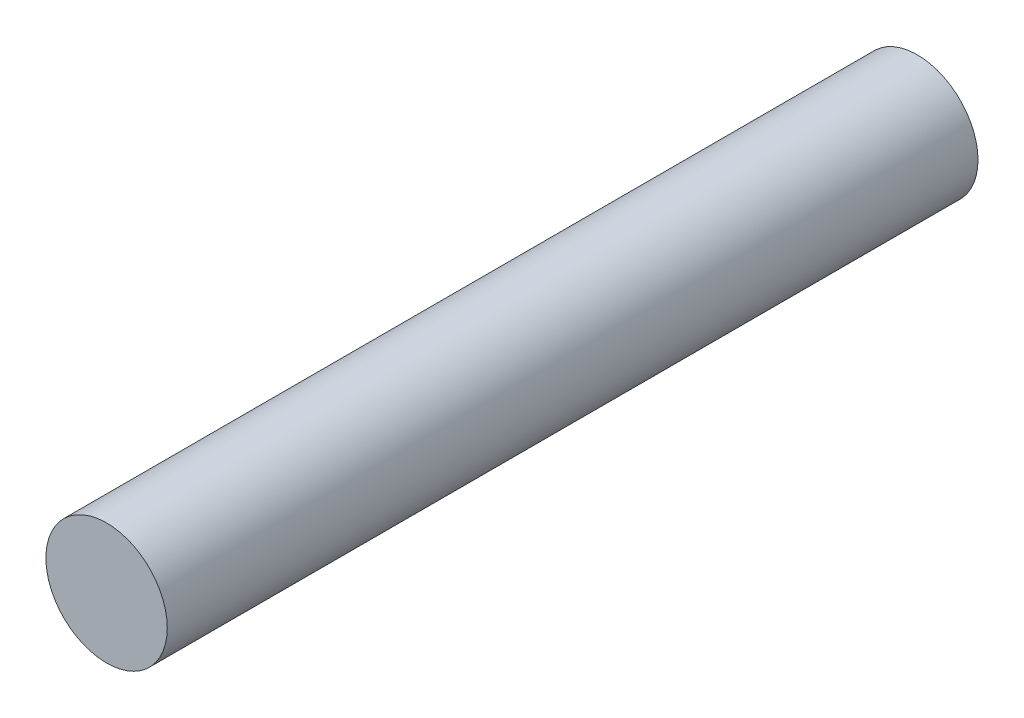
ISO-10303-21;
HEADER;
FILE_DESCRIPTION(('STEP AP214'),'2;1');
FILE_NAME('part.step','',(''),(''),'','','');
FILE_SCHEMA(('AUTOMOTIVE_DESIGN { 1 0 10303 214 1 1 1 1 }'));
ENDSEC;
DATA;
#1=APPLICATION_CONTEXT('core data for automotive mechanical design processes');
#2=APPLICATION_PROTOCOL_DEFINITION('international standard','automotive_design',2000,#1);
#3=PRODUCT_CONTEXT('',#1,'mechanical');
#4=PRODUCT('Part','Part','',(#3));
#5=PRODUCT_RELATED_PRODUCT_CATEGORY('part','',(#4));
#6=PRODUCT_DEFINITION_FORMATION('','',#4);
#7=PRODUCT_DEFINITION_CONTEXT('part definition',#1,'design');
#8=PRODUCT_DEFINITION('design','',#6,#7);
#9=PRODUCT_DEFINITION_SHAPE('','',#8);
#10=(LENGTH_UNIT() NAMED_UNIT(*) SI_UNIT(.MILLI.,.METRE.));
#11=(NAMED_UNIT(*) PLANE_ANGLE_UNIT() SI_UNIT($,.RADIAN.));
#12=(NAMED_UNIT(*) SI_UNIT($,.STERADIAN.) SOLID_ANGLE_UNIT());
#13=UNCERTAINTY_MEASURE_WITH_UNIT(LENGTH_MEASURE(1.E-05),#10,'distance_accuracy_value','');
#14=(GEOMETRIC_REPRESENTATION_CONTEXT(3) GLOBAL_UNCERTAINTY_ASSIGNED_CONTEXT((#13)) GLOBAL_UNIT_ASSIGNED_CONTEXT((#10,
#11,#12)) REPRESENTATION_CONTEXT('',''));
#15=CARTESIAN_POINT('',(0.,0.,0.));
#16=DIRECTION('',(0.,0.,1.));
#17=DIRECTION('',(1.,0.,0.));
#18=AXIS2_PLACEMENT_3D('',#15,#16,#17);
#19=CARTESIAN_POINT('',(-22.5508637895539,21.2253920386007,200.));
#20=DIRECTION('',(0.,0.,-1.));
#21=DIRECTION('',(-1.,0.,0.));
#22=AXIS2_PLACEMENT_3D('',#19,#20,#21);
#23=CYLINDRICAL_SURFACE('',#22,14.9721387684181);
#24=CARTESIAN_POINT('',(-22.5508637895539,21.2253920386007,200.));
#25=DIRECTION('',(0.,0.,1.));
#26=DIRECTION('',(1.,0.,0.));
#27=AXIS2_PLACEMENT_3D('',#24,#25,#26);
#28=CIRCLE('',#27,14.9721387684181);
#29=CARTESIAN_POINT('',(-7.57872502113578,21.2253920386007,200.));
#30=VERTEX_POINT('',#29);
#31=EDGE_CURVE('E10',#30,#30,#28,.T.);
#32=ORIENTED_EDGE('',*,*,#31,.F.);
#33=EDGE_LOOP('',(#32));
#34=FACE_BOUND('',#33,.T.);
#35=CARTESIAN_POINT('',(-22.5508637895539,21.2253920386007,0.));
#36=DIRECTION('',(0.,0.,1.));
#37=DIRECTION('',(1.,0.,0.));
#38=AXIS2_PLACEMENT_3D('',#35,#36,#37);
#39=CIRCLE('',#38,14.9721387684181);
#40=CARTESIAN_POINT('',(-7.57872502113578,21.2253920386007,0.));
#41=VERTEX_POINT('',#40);
#42=EDGE_CURVE('E44',#41,#41,#39,.T.);
#43=ORIENTED_EDGE('',*,*,#42,.T.);
#44=EDGE_LOOP('',(#43));
#45=FACE_BOUND('',#44,.T.);
#46=ADVANCED_FACE('F41',(#34,#45),#23,.T.);
#47=CARTESIAN_POINT('',(-22.5508637895539,21.2253920386007,200.));
#48=DIRECTION('',(0.,0.,1.));
#49=DIRECTION('',(1.,0.,0.));
#50=AXIS2_PLACEMENT_3D('',#47,#48,#49);
#51=PLANE('',#50);
#52=ORIENTED_EDGE('',*,*,#31,.T.);
#53=EDGE_LOOP('',(#52));
#54=FACE_BOUND('',#53,.T.);
#55=ADVANCED_FACE('F58',(#54),#51,.T.);
#56=CARTESIAN_POINT('',(-22.5508637895539,21.2253920386007,0.));
#57=DIRECTION('',(0.,0.,1.));
#58=DIRECTION('',(1.,0.,0.));
#59=AXIS2_PLACEMENT_3D('',#56,#57,#58);
#60=PLANE('',#59);
#61=ORIENTED_EDGE('',*,*,#42,.F.);
#62=EDGE_LOOP('',(#61));
#63=FACE_BOUND('',#62,.T.);
#64=ADVANCED_FACE('F56',(#63),#60,.F.);
#65=CLOSED_SHELL('',(#46,#55,#64));
#66=MANIFOLD_SOLID_BREP('B2',#65);
#67=ADVANCED_BREP_SHAPE_REPRESENTATION('',(#18,#66),#14);
#68=SHAPE_DEFINITION_REPRESENTATION(#9,#67);
ENDSEC;
END-ISO-10303-21;
